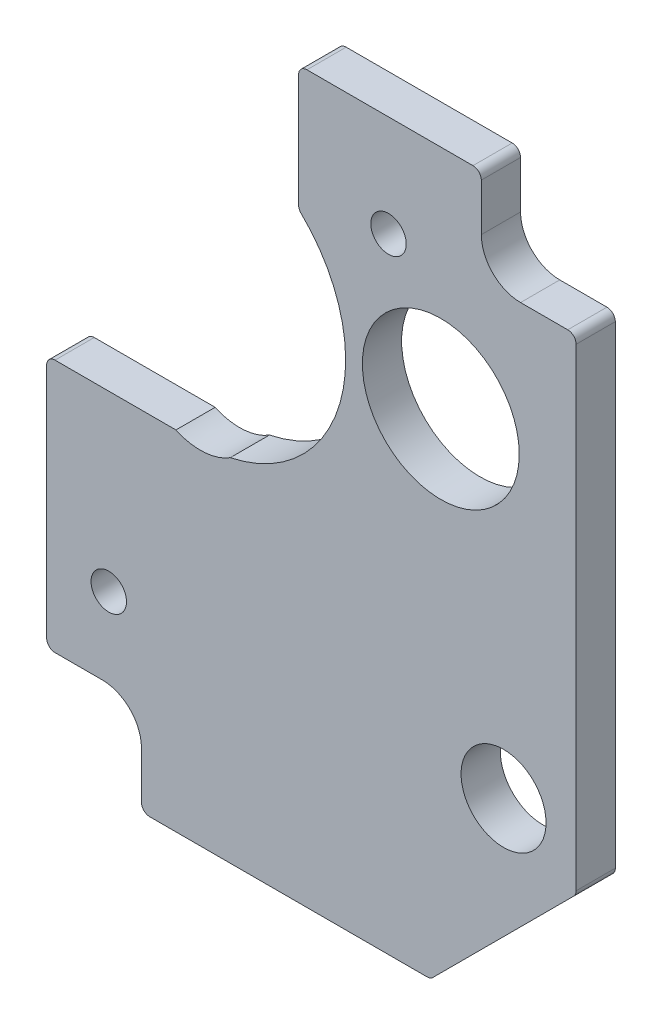
ISO-10303-21;
HEADER;
FILE_DESCRIPTION(('STEP AP214'),'2;1');
FILE_NAME('part.step','',(''),(''),'','','');
FILE_SCHEMA(('AUTOMOTIVE_DESIGN { 1 0 10303 214 1 1 1 1 }'));
ENDSEC;
DATA;
#1=APPLICATION_CONTEXT('core data for automotive mechanical design processes');
#2=APPLICATION_PROTOCOL_DEFINITION('international standard','automotive_design',2000,#1);
#3=PRODUCT_CONTEXT('',#1,'mechanical');
#4=PRODUCT('Part','Part','',(#3));
#5=PRODUCT_RELATED_PRODUCT_CATEGORY('part','',(#4));
#6=PRODUCT_DEFINITION_FORMATION('','',#4);
#7=PRODUCT_DEFINITION_CONTEXT('part definition',#1,'design');
#8=PRODUCT_DEFINITION('design','',#6,#7);
#9=PRODUCT_DEFINITION_SHAPE('','',#8);
#10=(LENGTH_UNIT() NAMED_UNIT(*) SI_UNIT(.MILLI.,.METRE.));
#11=(NAMED_UNIT(*) PLANE_ANGLE_UNIT() SI_UNIT($,.RADIAN.));
#12=(NAMED_UNIT(*) SI_UNIT($,.STERADIAN.) SOLID_ANGLE_UNIT());
#13=UNCERTAINTY_MEASURE_WITH_UNIT(LENGTH_MEASURE(1.E-05),#10,'distance_accuracy_value','');
#14=(GEOMETRIC_REPRESENTATION_CONTEXT(3) GLOBAL_UNCERTAINTY_ASSIGNED_CONTEXT((#13)) GLOBAL_UNIT_ASSIGNED_CONTEXT((#10,
#11,#12)) REPRESENTATION_CONTEXT('',''));
#15=CARTESIAN_POINT('',(0.,0.,0.));
#16=DIRECTION('',(0.,0.,1.));
#17=DIRECTION('',(1.,0.,0.));
#18=AXIS2_PLACEMENT_3D('',#15,#16,#17);
#19=CARTESIAN_POINT('',(-18.5024659793715,-87.4871250000004,4.7625));
#20=DIRECTION('',(0.,0.,-1.));
#21=DIRECTION('',(-1.,0.,0.));
#22=AXIS2_PLACEMENT_3D('',#19,#20,#21);
#23=CYLINDRICAL_SURFACE('',#22,1.016);
#24=CARTESIAN_POINT('',(-18.5024659793715,-87.4871250000004,0.));
#25=DIRECTION('',(0.,0.,1.));
#26=DIRECTION('',(1.,0.,0.));
#27=AXIS2_PLACEMENT_3D('',#24,#25,#26);
#28=CIRCLE('',#27,1.016);
#29=CARTESIAN_POINT('',(-18.5024659793715,-88.5031250000005,0.));
#30=VERTEX_POINT('',#29);
#31=CARTESIAN_POINT('',(-17.784045489686,-88.205545489686,0.));
#32=VERTEX_POINT('',#31);
#33=EDGE_CURVE('E236',#30,#32,#28,.T.);
#34=ORIENTED_EDGE('',*,*,#33,.T.);
#35=DIRECTION('',(0.,0.,-1.));
#36=VECTOR('',#35,1.);
#37=CARTESIAN_POINT('',(-17.784045489686,-88.205545489686,4.7625));
#38=LINE('',#37,#36);
#39=CARTESIAN_POINT('',(-17.784045489686,-88.205545489686,4.7625));
#40=VERTEX_POINT('',#39);
#41=EDGE_CURVE('E11',#40,#32,#38,.T.);
#42=ORIENTED_EDGE('',*,*,#41,.F.);
#43=CARTESIAN_POINT('',(-18.5024659793715,-87.4871250000004,4.7625));
#44=DIRECTION('',(0.,0.,1.));
#45=DIRECTION('',(1.,0.,0.));
#46=AXIS2_PLACEMENT_3D('',#43,#44,#45);
#47=CIRCLE('',#46,1.016);
#48=CARTESIAN_POINT('',(-18.5024659793715,-88.5031250000005,4.7625));
#49=VERTEX_POINT('',#48);
#50=EDGE_CURVE('E293',#49,#40,#47,.T.);
#51=ORIENTED_EDGE('',*,*,#50,.F.);
#52=DIRECTION('',(0.,0.,-1.));
#53=VECTOR('',#52,1.);
#54=CARTESIAN_POINT('',(-18.5024659793715,-88.5031250000005,4.7625));
#55=LINE('',#54,#53);
#56=EDGE_CURVE('E232',#49,#30,#55,.T.);
#57=ORIENTED_EDGE('',*,*,#56,.T.);
#58=EDGE_LOOP('',(#34,#42,#51,#57));
#59=FACE_BOUND('',#58,.T.);
#60=ADVANCED_FACE('F38',(#59),#23,.T.);
#61=CARTESIAN_POINT('',(-17.784045489686,-88.205545489686,4.7625));
#62=DIRECTION('',(-0.707106781186548,0.707106781186547,0.));
#63=DIRECTION('',(-0.707106781186547,-0.707106781186548,0.));
#64=AXIS2_PLACEMENT_3D('',#61,#62,#63);
#65=PLANE('',#64);
#66=DIRECTION('',(0.707106781186547,0.707106781186548,0.));
#67=VECTOR('',#66,1.);
#68=CARTESIAN_POINT('',(-17.784045489686,-88.205545489686,0.));
#69=LINE('',#68,#67);
#70=CARTESIAN_POINT('',(-0.694454510314901,-71.1159545103149,0.));
#71=VERTEX_POINT('',#70);
#72=EDGE_CURVE('E239',#32,#71,#69,.T.);
#73=ORIENTED_EDGE('',*,*,#72,.T.);
#74=DIRECTION('',(0.,0.,-1.));
#75=VECTOR('',#74,1.);
#76=CARTESIAN_POINT('',(-0.694454510314901,-71.1159545103149,4.7625));
#77=LINE('',#76,#75);
#78=CARTESIAN_POINT('',(-0.694454510314901,-71.1159545103149,4.7625));
#79=VERTEX_POINT('',#78);
#80=EDGE_CURVE('E46',#79,#71,#77,.T.);
#81=ORIENTED_EDGE('',*,*,#80,.F.);
#82=DIRECTION('',(0.707106781186547,0.707106781186548,0.));
#83=VECTOR('',#82,1.);
#84=CARTESIAN_POINT('',(-17.784045489686,-88.205545489686,4.7625));
#85=LINE('',#84,#83);
#86=EDGE_CURVE('E147',#40,#79,#85,.T.);
#87=ORIENTED_EDGE('',*,*,#86,.F.);
#88=ORIENTED_EDGE('',*,*,#41,.T.);
#89=EDGE_LOOP('',(#73,#81,#87,#88));
#90=FACE_BOUND('',#89,.T.);
#91=ADVANCED_FACE('F462',(#90),#65,.F.);
#92=CARTESIAN_POINT('',(-1.41287500000043,-70.3975340206292,4.7625));
#93=DIRECTION('',(0.,0.,-1.));
#94=DIRECTION('',(-1.,0.,0.));
#95=AXIS2_PLACEMENT_3D('',#92,#93,#94);
#96=CYLINDRICAL_SURFACE('',#95,1.01600000000007);
#97=CARTESIAN_POINT('',(-1.41287500000043,-70.3975340206292,0.));
#98=DIRECTION('',(0.,0.,1.));
#99=DIRECTION('',(1.,0.,0.));
#100=AXIS2_PLACEMENT_3D('',#97,#98,#99);
#101=CIRCLE('',#100,1.01600000000007);
#102=CARTESIAN_POINT('',(-0.396875000000381,-70.3975340206292,0.));
#103=VERTEX_POINT('',#102);
#104=EDGE_CURVE('E242',#71,#103,#101,.T.);
#105=ORIENTED_EDGE('',*,*,#104,.T.);
#106=DIRECTION('',(0.,0.,-1.));
#107=VECTOR('',#106,1.);
#108=CARTESIAN_POINT('',(-0.396875000000381,-70.3975340206292,4.7625));
#109=LINE('',#108,#107);
#110=CARTESIAN_POINT('',(-0.396875000000381,-70.3975340206292,4.7625));
#111=VERTEX_POINT('',#110);
#112=EDGE_CURVE('E352',#111,#103,#109,.T.);
#113=ORIENTED_EDGE('',*,*,#112,.F.);
#114=CARTESIAN_POINT('',(-1.41287500000043,-70.3975340206292,4.7625));
#115=DIRECTION('',(0.,0.,1.));
#116=DIRECTION('',(1.,0.,0.));
#117=AXIS2_PLACEMENT_3D('',#114,#115,#116);
#118=CIRCLE('',#117,1.01600000000007);
#119=EDGE_CURVE('E360',#79,#111,#118,.T.);
#120=ORIENTED_EDGE('',*,*,#119,.F.);
#121=ORIENTED_EDGE('',*,*,#80,.T.);
#122=EDGE_LOOP('',(#105,#113,#120,#121));
#123=FACE_BOUND('',#122,.T.);
#124=ADVANCED_FACE('F358',(#123),#96,.T.);
#125=CARTESIAN_POINT('',(-0.396875000000381,-70.3975340206292,4.7625));
#126=DIRECTION('',(-1.,0.,0.));
#127=DIRECTION('',(0.,-1.,0.));
#128=AXIS2_PLACEMENT_3D('',#125,#126,#127);
#129=PLANE('',#128);
#130=DIRECTION('',(0.,1.,0.));
#131=VECTOR('',#130,1.);
#132=CARTESIAN_POINT('',(-0.396875000000381,-70.3975340206292,0.));
#133=LINE('',#132,#131);
#134=CARTESIAN_POINT('',(-0.396875000000459,-12.9222500000004,0.));
#135=VERTEX_POINT('',#134);
#136=EDGE_CURVE('E244',#103,#135,#133,.T.);
#137=ORIENTED_EDGE('',*,*,#136,.T.);
#138=DIRECTION('',(0.,0.,-1.));
#139=VECTOR('',#138,1.);
#140=CARTESIAN_POINT('',(-0.396875000000459,-12.9222500000004,4.7625));
#141=LINE('',#140,#139);
#142=CARTESIAN_POINT('',(-0.396875000000459,-12.9222500000004,4.7625));
#143=VERTEX_POINT('',#142);
#144=EDGE_CURVE('E349',#143,#135,#141,.T.);
#145=ORIENTED_EDGE('',*,*,#144,.F.);
#146=DIRECTION('',(0.,1.,0.));
#147=VECTOR('',#146,1.);
#148=CARTESIAN_POINT('',(-0.396875000000381,-70.3975340206292,4.7625));
#149=LINE('',#148,#147);
#150=EDGE_CURVE('E378',#111,#143,#149,.T.);
#151=ORIENTED_EDGE('',*,*,#150,.F.);
#152=ORIENTED_EDGE('',*,*,#112,.T.);
#153=EDGE_LOOP('',(#137,#145,#151,#152));
#154=FACE_BOUND('',#153,.T.);
#155=ADVANCED_FACE('F369',(#154),#129,.F.);
#156=CARTESIAN_POINT('',(-1.41287500000046,-12.9222500000004,4.7625));
#157=DIRECTION('',(0.,0.,-1.));
#158=DIRECTION('',(-1.,0.,0.));
#159=AXIS2_PLACEMENT_3D('',#156,#157,#158);
#160=CYLINDRICAL_SURFACE('',#159,1.016);
#161=CARTESIAN_POINT('',(-1.41287500000046,-12.9222500000004,0.));
#162=DIRECTION('',(0.,0.,1.));
#163=DIRECTION('',(1.,0.,0.));
#164=AXIS2_PLACEMENT_3D('',#161,#162,#163);
#165=CIRCLE('',#164,1.016);
#166=CARTESIAN_POINT('',(-1.41287500000046,-11.9062500000004,0.));
#167=VERTEX_POINT('',#166);
#168=EDGE_CURVE('E247',#135,#167,#165,.T.);
#169=ORIENTED_EDGE('',*,*,#168,.T.);
#170=DIRECTION('',(0.,0.,-1.));
#171=VECTOR('',#170,1.);
#172=CARTESIAN_POINT('',(-1.41287500000046,-11.9062500000004,4.7625));
#173=LINE('',#172,#171);
#174=CARTESIAN_POINT('',(-1.41287500000046,-11.9062500000004,4.7625));
#175=VERTEX_POINT('',#174);
#176=EDGE_CURVE('E346',#175,#167,#173,.T.);
#177=ORIENTED_EDGE('',*,*,#176,.F.);
#178=CARTESIAN_POINT('',(-1.41287500000046,-12.9222500000004,4.7625));
#179=DIRECTION('',(0.,0.,1.));
#180=DIRECTION('',(1.,0.,0.));
#181=AXIS2_PLACEMENT_3D('',#178,#179,#180);
#182=CIRCLE('',#181,1.016);
#183=EDGE_CURVE('E375',#143,#175,#182,.T.);
#184=ORIENTED_EDGE('',*,*,#183,.F.);
#185=ORIENTED_EDGE('',*,*,#144,.T.);
#186=EDGE_LOOP('',(#169,#177,#184,#185));
#187=FACE_BOUND('',#186,.T.);
#188=ADVANCED_FACE('F373',(#187),#160,.T.);
#189=CARTESIAN_POINT('',(-1.41287500000046,-11.9062500000004,4.7625));
#190=DIRECTION('',(0.,-1.,0.));
#191=DIRECTION('',(1.,0.,0.));
#192=AXIS2_PLACEMENT_3D('',#189,#190,#191);
#193=PLANE('',#192);
#194=DIRECTION('',(-1.,0.,0.));
#195=VECTOR('',#194,1.);
#196=CARTESIAN_POINT('',(-1.41287500000046,-11.9062500000004,0.));
#197=LINE('',#196,#195);
#198=CARTESIAN_POINT('',(-7.14375000000044,-11.9062500000004,0.));
#199=VERTEX_POINT('',#198);
#200=EDGE_CURVE('E249',#167,#199,#197,.T.);
#201=ORIENTED_EDGE('',*,*,#200,.T.);
#202=DIRECTION('',(0.,0.,-1.));
#203=VECTOR('',#202,1.);
#204=CARTESIAN_POINT('',(-7.14375000000044,-11.9062500000004,4.7625));
#205=LINE('',#204,#203);
#206=CARTESIAN_POINT('',(-7.14375000000044,-11.9062500000004,4.7625));
#207=VERTEX_POINT('',#206);
#208=EDGE_CURVE('E343',#207,#199,#205,.T.);
#209=ORIENTED_EDGE('',*,*,#208,.F.);
#210=DIRECTION('',(-1.,0.,0.));
#211=VECTOR('',#210,1.);
#212=CARTESIAN_POINT('',(-1.41287500000046,-11.9062500000004,4.7625));
#213=LINE('',#212,#211);
#214=EDGE_CURVE('E377',#175,#207,#213,.T.);
#215=ORIENTED_EDGE('',*,*,#214,.F.);
#216=ORIENTED_EDGE('',*,*,#176,.T.);
#217=EDGE_LOOP('',(#201,#209,#215,#216));
#218=FACE_BOUND('',#217,.T.);
#219=ADVANCED_FACE('F452',(#218),#193,.F.);
#220=CARTESIAN_POINT('',(-7.14375000000044,-7.14375000000045,4.7625));
#221=DIRECTION('',(0.,0.,-1.));
#222=DIRECTION('',(-1.,0.,0.));
#223=AXIS2_PLACEMENT_3D('',#220,#221,#222);
#224=CYLINDRICAL_SURFACE('',#223,4.7625);
#225=CARTESIAN_POINT('',(-7.14375000000044,-7.14375000000045,0.));
#226=DIRECTION('',(0.,0.,-1.));
#227=DIRECTION('',(1.,0.,0.));
#228=AXIS2_PLACEMENT_3D('',#225,#226,#227);
#229=CIRCLE('',#228,4.7625);
#230=CARTESIAN_POINT('',(-11.9062500000004,-7.14375000000045,0.));
#231=VERTEX_POINT('',#230);
#232=EDGE_CURVE('E251',#199,#231,#229,.T.);
#233=ORIENTED_EDGE('',*,*,#232,.T.);
#234=DIRECTION('',(0.,0.,-1.));
#235=VECTOR('',#234,1.);
#236=CARTESIAN_POINT('',(-11.9062500000004,-7.14375000000045,4.7625));
#237=LINE('',#236,#235);
#238=CARTESIAN_POINT('',(-11.9062500000004,-7.14375000000045,4.7625));
#239=VERTEX_POINT('',#238);
#240=EDGE_CURVE('E340',#239,#231,#237,.T.);
#241=ORIENTED_EDGE('',*,*,#240,.F.);
#242=CARTESIAN_POINT('',(-7.14375000000044,-7.14375000000045,4.7625));
#243=DIRECTION('',(0.,0.,-1.));
#244=DIRECTION('',(1.,0.,0.));
#245=AXIS2_PLACEMENT_3D('',#242,#243,#244);
#246=CIRCLE('',#245,4.7625);
#247=EDGE_CURVE('E380',#207,#239,#246,.T.);
#248=ORIENTED_EDGE('',*,*,#247,.F.);
#249=ORIENTED_EDGE('',*,*,#208,.T.);
#250=EDGE_LOOP('',(#233,#241,#248,#249));
#251=FACE_BOUND('',#250,.T.);
#252=ADVANCED_FACE('F448',(#251),#224,.F.);
#253=CARTESIAN_POINT('',(-11.9062500000004,-7.14375000000045,4.7625));
#254=DIRECTION('',(-1.,0.,0.));
#255=DIRECTION('',(0.,0.,1.));
#256=AXIS2_PLACEMENT_3D('',#253,#254,#255);
#257=PLANE('',#256);
#258=DIRECTION('',(0.,1.,0.));
#259=VECTOR('',#258,1.);
#260=CARTESIAN_POINT('',(-11.9062500000004,-7.14375000000045,0.));
#261=LINE('',#260,#259);
#262=CARTESIAN_POINT('',(-11.9062500000004,-1.41287500000045,0.));
#263=VERTEX_POINT('',#262);
#264=EDGE_CURVE('E253',#231,#263,#261,.T.);
#265=ORIENTED_EDGE('',*,*,#264,.T.);
#266=DIRECTION('',(0.,0.,-1.));
#267=VECTOR('',#266,1.);
#268=CARTESIAN_POINT('',(-11.9062500000004,-1.41287500000045,4.7625));
#269=LINE('',#268,#267);
#270=CARTESIAN_POINT('',(-11.9062500000004,-1.41287500000045,4.7625));
#271=VERTEX_POINT('',#270);
#272=EDGE_CURVE('E337',#271,#263,#269,.T.);
#273=ORIENTED_EDGE('',*,*,#272,.F.);
#274=DIRECTION('',(0.,1.,0.));
#275=VECTOR('',#274,1.);
#276=CARTESIAN_POINT('',(-11.9062500000004,-7.14375000000045,4.7625));
#277=LINE('',#276,#275);
#278=EDGE_CURVE('E387',#239,#271,#277,.T.);
#279=ORIENTED_EDGE('',*,*,#278,.F.);
#280=ORIENTED_EDGE('',*,*,#240,.T.);
#281=EDGE_LOOP('',(#265,#273,#279,#280));
#282=FACE_BOUND('',#281,.T.);
#283=ADVANCED_FACE('F444',(#282),#257,.F.);
#284=CARTESIAN_POINT('',(-12.9222500000004,-1.41287500000045,4.7625));
#285=DIRECTION('',(0.,0.,-1.));
#286=DIRECTION('',(-1.,0.,0.));
#287=AXIS2_PLACEMENT_3D('',#284,#285,#286);
#288=CYLINDRICAL_SURFACE('',#287,1.016);
#289=CARTESIAN_POINT('',(-12.9222500000004,-1.41287500000045,0.));
#290=DIRECTION('',(0.,0.,1.));
#291=DIRECTION('',(1.,0.,0.));
#292=AXIS2_PLACEMENT_3D('',#289,#290,#291);
#293=CIRCLE('',#292,1.016);
#294=CARTESIAN_POINT('',(-12.9222500000004,-0.396875000000448,0.));
#295=VERTEX_POINT('',#294);
#296=EDGE_CURVE('E255',#263,#295,#293,.T.);
#297=ORIENTED_EDGE('',*,*,#296,.T.);
#298=DIRECTION('',(0.,0.,-1.));
#299=VECTOR('',#298,1.);
#300=CARTESIAN_POINT('',(-12.9222500000004,-0.396875000000448,4.7625));
#301=LINE('',#300,#299);
#302=CARTESIAN_POINT('',(-12.9222500000004,-0.396875000000448,4.7625));
#303=VERTEX_POINT('',#302);
#304=EDGE_CURVE('E334',#303,#295,#301,.T.);
#305=ORIENTED_EDGE('',*,*,#304,.F.);
#306=CARTESIAN_POINT('',(-12.9222500000004,-1.41287500000045,4.7625));
#307=DIRECTION('',(0.,0.,1.));
#308=DIRECTION('',(1.,0.,0.));
#309=AXIS2_PLACEMENT_3D('',#306,#307,#308);
#310=CIRCLE('',#309,1.016);
#311=EDGE_CURVE('E389',#271,#303,#310,.T.);
#312=ORIENTED_EDGE('',*,*,#311,.F.);
#313=ORIENTED_EDGE('',*,*,#272,.T.);
#314=EDGE_LOOP('',(#297,#305,#312,#313));
#315=FACE_BOUND('',#314,.T.);
#316=ADVANCED_FACE('F440',(#315),#288,.T.);
#317=CARTESIAN_POINT('',(-12.9222500000004,-0.396875000000448,4.7625));
#318=DIRECTION('',(0.,-1.,0.));
#319=DIRECTION('',(1.,0.,0.));
#320=AXIS2_PLACEMENT_3D('',#317,#318,#319);
#321=PLANE('',#320);
#322=DIRECTION('',(-1.,0.,0.));
#323=VECTOR('',#322,1.);
#324=CARTESIAN_POINT('',(-12.9222500000004,-0.396875000000448,0.));
#325=LINE('',#324,#323);
#326=CARTESIAN_POINT('',(-33.0835000000004,-0.396875000000452,0.));
#327=VERTEX_POINT('',#326);
#328=EDGE_CURVE('E257',#295,#327,#325,.T.);
#329=ORIENTED_EDGE('',*,*,#328,.T.);
#330=DIRECTION('',(0.,0.,-1.));
#331=VECTOR('',#330,1.);
#332=CARTESIAN_POINT('',(-33.0835000000004,-0.396875000000452,4.7625));
#333=LINE('',#332,#331);
#334=CARTESIAN_POINT('',(-33.0835000000004,-0.396875000000452,4.7625));
#335=VERTEX_POINT('',#334);
#336=EDGE_CURVE('E331',#335,#327,#333,.T.);
#337=ORIENTED_EDGE('',*,*,#336,.F.);
#338=DIRECTION('',(-1.,0.,0.));
#339=VECTOR('',#338,1.);
#340=CARTESIAN_POINT('',(-12.9222500000004,-0.396875000000448,4.7625));
#341=LINE('',#340,#339);
#342=EDGE_CURVE('E391',#303,#335,#341,.T.);
#343=ORIENTED_EDGE('',*,*,#342,.F.);
#344=ORIENTED_EDGE('',*,*,#304,.T.);
#345=EDGE_LOOP('',(#329,#337,#343,#344));
#346=FACE_BOUND('',#345,.T.);
#347=ADVANCED_FACE('F436',(#346),#321,.F.);
#348=CARTESIAN_POINT('',(-33.0835000000004,-1.41287500000045,4.7625));
#349=DIRECTION('',(0.,0.,-1.));
#350=DIRECTION('',(-1.,0.,0.));
#351=AXIS2_PLACEMENT_3D('',#348,#349,#350);
#352=CYLINDRICAL_SURFACE('',#351,1.016);
#353=CARTESIAN_POINT('',(-33.0835000000004,-1.41287500000045,0.));
#354=DIRECTION('',(0.,0.,1.));
#355=DIRECTION('',(1.,0.,0.));
#356=AXIS2_PLACEMENT_3D('',#353,#354,#355);
#357=CIRCLE('',#356,1.016);
#358=CARTESIAN_POINT('',(-34.0995000000004,-1.41287500000045,0.));
#359=VERTEX_POINT('',#358);
#360=EDGE_CURVE('E259',#327,#359,#357,.T.);
#361=ORIENTED_EDGE('',*,*,#360,.T.);
#362=DIRECTION('',(0.,0.,-1.));
#363=VECTOR('',#362,1.);
#364=CARTESIAN_POINT('',(-34.0995000000004,-1.41287500000045,4.7625));
#365=LINE('',#364,#363);
#366=CARTESIAN_POINT('',(-34.0995000000004,-1.41287500000045,4.7625));
#367=VERTEX_POINT('',#366);
#368=EDGE_CURVE('E328',#367,#359,#365,.T.);
#369=ORIENTED_EDGE('',*,*,#368,.F.);
#370=CARTESIAN_POINT('',(-33.0835000000004,-1.41287500000045,4.7625));
#371=DIRECTION('',(0.,0.,1.));
#372=DIRECTION('',(1.,0.,0.));
#373=AXIS2_PLACEMENT_3D('',#370,#371,#372);
#374=CIRCLE('',#373,1.016);
#375=EDGE_CURVE('E393',#335,#367,#374,.T.);
#376=ORIENTED_EDGE('',*,*,#375,.F.);
#377=ORIENTED_EDGE('',*,*,#336,.T.);
#378=EDGE_LOOP('',(#361,#369,#376,#377));
#379=FACE_BOUND('',#378,.T.);
#380=ADVANCED_FACE('F432',(#379),#352,.T.);
#381=CARTESIAN_POINT('',(-34.0995000000004,-1.41287500000045,4.7625));
#382=DIRECTION('',(1.,0.,0.));
#383=DIRECTION('',(0.,1.,0.));
#384=AXIS2_PLACEMENT_3D('',#381,#382,#383);
#385=PLANE('',#384);
#386=DIRECTION('',(0.,-1.,0.));
#387=VECTOR('',#386,1.);
#388=CARTESIAN_POINT('',(-34.0995000000004,-1.41287500000045,0.));
#389=LINE('',#388,#387);
#390=CARTESIAN_POINT('',(-34.0995000000004,-15.1315835815449,0.));
#391=VERTEX_POINT('',#390);
#392=EDGE_CURVE('E261',#359,#391,#389,.T.);
#393=ORIENTED_EDGE('',*,*,#392,.T.);
#394=DIRECTION('',(0.,0.,-1.));
#395=VECTOR('',#394,1.);
#396=CARTESIAN_POINT('',(-34.0995000000004,-15.1315835815449,4.7625));
#397=LINE('',#396,#395);
#398=CARTESIAN_POINT('',(-34.0995000000004,-15.1315835815449,4.7625));
#399=VERTEX_POINT('',#398);
#400=EDGE_CURVE('E325',#399,#391,#397,.T.);
#401=ORIENTED_EDGE('',*,*,#400,.F.);
#402=DIRECTION('',(0.,-1.,0.));
#403=VECTOR('',#402,1.);
#404=CARTESIAN_POINT('',(-34.0995000000004,-1.41287500000045,4.7625));
#405=LINE('',#404,#403);
#406=EDGE_CURVE('E395',#367,#399,#405,.T.);
#407=ORIENTED_EDGE('',*,*,#406,.F.);
#408=ORIENTED_EDGE('',*,*,#368,.T.);
#409=EDGE_LOOP('',(#393,#401,#407,#408));
#410=FACE_BOUND('',#409,.T.);
#411=ADVANCED_FACE('F428',(#410),#385,.F.);
#412=CARTESIAN_POINT('',(-33.0835000000004,-15.1315835815449,4.7625));
#413=DIRECTION('',(0.,0.,-1.));
#414=DIRECTION('',(-1.,0.,0.));
#415=AXIS2_PLACEMENT_3D('',#412,#413,#414);
#416=CYLINDRICAL_SURFACE('',#415,1.01599999999999);
#417=CARTESIAN_POINT('',(-33.0835000000004,-15.1315835815449,0.));
#418=DIRECTION('',(0.,0.,1.));
#419=DIRECTION('',(1.,0.,0.));
#420=AXIS2_PLACEMENT_3D('',#417,#418,#419);
#421=CIRCLE('',#420,1.01599999999999);
#422=CARTESIAN_POINT('',(-33.7884795918372,-15.8631980805084,0.));
#423=VERTEX_POINT('',#422);
#424=EDGE_CURVE('E263',#391,#423,#421,.T.);
#425=ORIENTED_EDGE('',*,*,#424,.T.);
#426=DIRECTION('',(0.,0.,-1.));
#427=VECTOR('',#426,1.);
#428=CARTESIAN_POINT('',(-33.7884795918372,-15.8631980805084,4.7625));
#429=LINE('',#428,#427);
#430=CARTESIAN_POINT('',(-33.7884795918372,-15.8631980805084,4.7625));
#431=VERTEX_POINT('',#430);
#432=EDGE_CURVE('E322',#431,#423,#429,.T.);
#433=ORIENTED_EDGE('',*,*,#432,.F.);
#434=CARTESIAN_POINT('',(-33.0835000000004,-15.1315835815449,4.7625));
#435=DIRECTION('',(0.,0.,1.));
#436=DIRECTION('',(1.,0.,0.));
#437=AXIS2_PLACEMENT_3D('',#434,#435,#436);
#438=CIRCLE('',#437,1.01599999999999);
#439=EDGE_CURVE('E397',#399,#431,#438,.T.);
#440=ORIENTED_EDGE('',*,*,#439,.F.);
#441=ORIENTED_EDGE('',*,*,#400,.T.);
#442=EDGE_LOOP('',(#425,#433,#440,#441));
#443=FACE_BOUND('',#442,.T.);
#444=ADVANCED_FACE('F424',(#443),#416,.T.);
#445=CARTESIAN_POINT('',(-46.0375000000004,-28.5750000000005,4.7625));
#446=DIRECTION('',(0.,0.,-1.));
#447=DIRECTION('',(-1.,0.,0.));
#448=AXIS2_PLACEMENT_3D('',#445,#446,#447);
#449=CYLINDRICAL_SURFACE('',#448,17.653);
#450=CARTESIAN_POINT('',(-46.0375000000004,-28.5750000000005,0.));
#451=DIRECTION('',(0.,0.,-1.));
#452=DIRECTION('',(1.,0.,0.));
#453=AXIS2_PLACEMENT_3D('',#450,#451,#452);
#454=CIRCLE('',#453,17.653);
#455=CARTESIAN_POINT('',(-42.3979028671247,-45.8487298146747,0.));
#456=VERTEX_POINT('',#455);
#457=EDGE_CURVE('E265',#423,#456,#454,.T.);
#458=ORIENTED_EDGE('',*,*,#457,.T.);
#459=DIRECTION('',(0.,0.,-1.));
#460=VECTOR('',#459,1.);
#461=CARTESIAN_POINT('',(-42.3979028671247,-45.8487298146747,4.7625));
#462=LINE('',#461,#460);
#463=CARTESIAN_POINT('',(-42.3979028671247,-45.8487298146747,4.7625));
#464=VERTEX_POINT('',#463);
#465=EDGE_CURVE('E318',#464,#456,#462,.T.);
#466=ORIENTED_EDGE('',*,*,#465,.F.);
#467=CARTESIAN_POINT('',(-46.0375000000004,-28.5750000000005,4.7625));
#468=DIRECTION('',(0.,0.,-1.));
#469=DIRECTION('',(1.,0.,0.));
#470=AXIS2_PLACEMENT_3D('',#467,#468,#469);
#471=CIRCLE('',#470,17.653);
#472=EDGE_CURVE('E399',#431,#464,#471,.T.);
#473=ORIENTED_EDGE('',*,*,#472,.F.);
#474=ORIENTED_EDGE('',*,*,#432,.T.);
#475=EDGE_LOOP('',(#458,#466,#473,#474));
#476=FACE_BOUND('',#475,.T.);
#477=ADVANCED_FACE('F419',(#476),#449,.F.);
#478=CARTESIAN_POINT('',(-42.3979028671247,-45.8487298146747,4.7625));
#479=CARTESIAN_POINT('',(-45.5517831985528,-47.8607532054006,4.7625));
#480=CARTESIAN_POINT('',(-48.9910262425178,-46.2280000000004,4.7625));
#481=(BOUNDED_CURVE() B_SPLINE_CURVE(2,(#478,#479,#480),.UNSPECIFIED.,.F.,
.F.) B_SPLINE_CURVE_WITH_KNOTS((3,3),(-2.21061099064347,-1.06500214378853),
.UNSPECIFIED.) CURVE() GEOMETRIC_REPRESENTATION_ITEM() RATIONAL_B_SPLINE_CURVE((1.,
0.840384309700957,1.)) REPRESENTATION_ITEM(''));
#482=DIRECTION('',(0.,0.,-1.));
#483=VECTOR('',#482,1.);
#484=SURFACE_OF_LINEAR_EXTRUSION('',#481,#483);
#485=CARTESIAN_POINT('',(-42.3979028671247,-45.8487298146747,0.));
#486=CARTESIAN_POINT('',(-45.5517831985528,-47.8607532054006,0.));
#487=CARTESIAN_POINT('',(-48.9910262425178,-46.2280000000004,0.));
#488=(BOUNDED_CURVE() B_SPLINE_CURVE(2,(#485,#486,#487),.UNSPECIFIED.,.F.,
.F.) B_SPLINE_CURVE_WITH_KNOTS((3,3),(-2.21061099064347,-1.06500214378853),
.UNSPECIFIED.) CURVE() GEOMETRIC_REPRESENTATION_ITEM() RATIONAL_B_SPLINE_CURVE((1.,
0.840384309700957,1.)) REPRESENTATION_ITEM(''));
#489=CARTESIAN_POINT('',(-48.9910262425178,-46.2280000000004,0.));
#490=VERTEX_POINT('',#489);
#491=EDGE_CURVE('E268',#456,#490,#488,.T.);
#492=ORIENTED_EDGE('',*,*,#491,.T.);
#493=DIRECTION('',(0.,0.,-1.));
#494=VECTOR('',#493,1.);
#495=CARTESIAN_POINT('',(-48.9910262425178,-46.2280000000004,4.7625));
#496=LINE('',#495,#494);
#497=CARTESIAN_POINT('',(-48.9910262425178,-46.2280000000004,4.7625));
#498=VERTEX_POINT('',#497);
#499=EDGE_CURVE('E314',#498,#490,#496,.T.);
#500=ORIENTED_EDGE('',*,*,#499,.F.);
#501=EDGE_CURVE('E402',#464,#498,#481,.T.);
#502=ORIENTED_EDGE('',*,*,#501,.F.);
#503=ORIENTED_EDGE('',*,*,#465,.T.);
#504=EDGE_LOOP('',(#492,#500,#502,#503));
#505=FACE_BOUND('',#504,.T.);
#506=ADVANCED_FACE('F414',(#505),#484,.F.);
#507=CARTESIAN_POINT('',(-48.9910262425178,-46.2280000000004,4.7625));
#508=DIRECTION('',(0.,-1.,0.));
#509=DIRECTION('',(1.,0.,0.));
#510=AXIS2_PLACEMENT_3D('',#507,#508,#509);
#511=PLANE('',#510);
#512=DIRECTION('',(-1.,0.,0.));
#513=VECTOR('',#512,1.);
#514=CARTESIAN_POINT('',(-48.9910262425178,-46.2280000000004,0.));
#515=LINE('',#514,#513);
#516=CARTESIAN_POINT('',(-63.6746250000004,-46.2280000000005,0.));
#517=VERTEX_POINT('',#516);
#518=EDGE_CURVE('E273',#490,#517,#515,.T.);
#519=ORIENTED_EDGE('',*,*,#518,.T.);
#520=DIRECTION('',(0.,0.,-1.));
#521=VECTOR('',#520,1.);
#522=CARTESIAN_POINT('',(-63.6746250000004,-46.2280000000005,4.7625));
#523=LINE('',#522,#521);
#524=CARTESIAN_POINT('',(-63.6746250000004,-46.2280000000005,4.7625));
#525=VERTEX_POINT('',#524);
#526=EDGE_CURVE('E310',#525,#517,#523,.T.);
#527=ORIENTED_EDGE('',*,*,#526,.F.);
#528=DIRECTION('',(-1.,0.,0.));
#529=VECTOR('',#528,1.);
#530=CARTESIAN_POINT('',(-48.9910262425178,-46.2280000000004,4.7625));
#531=LINE('',#530,#529);
#532=EDGE_CURVE('E408',#498,#525,#531,.T.);
#533=ORIENTED_EDGE('',*,*,#532,.F.);
#534=ORIENTED_EDGE('',*,*,#499,.T.);
#535=EDGE_LOOP('',(#519,#527,#533,#534));
#536=FACE_BOUND('',#535,.T.);
#537=ADVANCED_FACE('F418',(#536),#511,.F.);
#538=CARTESIAN_POINT('',(-63.6746250000004,-47.2440000000005,4.7625));
#539=DIRECTION('',(0.,0.,-1.));
#540=DIRECTION('',(-1.,0.,0.));
#541=AXIS2_PLACEMENT_3D('',#538,#539,#540);
#542=CYLINDRICAL_SURFACE('',#541,1.016);
#543=CARTESIAN_POINT('',(-63.6746250000004,-47.2440000000005,0.));
#544=DIRECTION('',(0.,0.,1.));
#545=DIRECTION('',(1.,0.,0.));
#546=AXIS2_PLACEMENT_3D('',#543,#544,#545);
#547=CIRCLE('',#546,1.016);
#548=CARTESIAN_POINT('',(-64.6906250000005,-47.2440000000005,0.));
#549=VERTEX_POINT('',#548);
#550=EDGE_CURVE('E279',#517,#549,#547,.T.);
#551=ORIENTED_EDGE('',*,*,#550,.T.);
#552=DIRECTION('',(0.,0.,-1.));
#553=VECTOR('',#552,1.);
#554=CARTESIAN_POINT('',(-64.6906250000005,-47.2440000000005,4.7625));
#555=LINE('',#554,#553);
#556=CARTESIAN_POINT('',(-64.6906250000005,-47.2440000000005,4.7625));
#557=VERTEX_POINT('',#556);
#558=EDGE_CURVE('E306',#557,#549,#555,.T.);
#559=ORIENTED_EDGE('',*,*,#558,.F.);
#560=CARTESIAN_POINT('',(-63.6746250000004,-47.2440000000005,4.7625));
#561=DIRECTION('',(0.,0.,1.));
#562=DIRECTION('',(1.,0.,0.));
#563=AXIS2_PLACEMENT_3D('',#560,#561,#562);
#564=CIRCLE('',#563,1.016);
#565=EDGE_CURVE('E497',#525,#557,#564,.T.);
#566=ORIENTED_EDGE('',*,*,#565,.F.);
#567=ORIENTED_EDGE('',*,*,#526,.T.);
#568=EDGE_LOOP('',(#551,#559,#566,#567));
#569=FACE_BOUND('',#568,.T.);
#570=ADVANCED_FACE('F496',(#569),#542,.T.);
#571=CARTESIAN_POINT('',(-64.6906250000005,-47.2440000000005,4.7625));
#572=DIRECTION('',(1.,0.,0.));
#573=DIRECTION('',(0.,0.,-1.));
#574=AXIS2_PLACEMENT_3D('',#571,#572,#573);
#575=PLANE('',#574);
#576=DIRECTION('',(0.,-1.,0.));
#577=VECTOR('',#576,1.);
#578=CARTESIAN_POINT('',(-64.6906250000005,-47.2440000000005,0.));
#579=LINE('',#578,#577);
#580=CARTESIAN_POINT('',(-64.6906250000005,-75.9777500000005,0.));
#581=VERTEX_POINT('',#580);
#582=EDGE_CURVE('E282',#549,#581,#579,.T.);
#583=ORIENTED_EDGE('',*,*,#582,.T.);
#584=DIRECTION('',(0.,0.,-1.));
#585=VECTOR('',#584,1.);
#586=CARTESIAN_POINT('',(-64.6906250000005,-75.9777500000005,4.7625));
#587=LINE('',#586,#585);
#588=CARTESIAN_POINT('',(-64.6906250000005,-75.9777500000005,4.7625));
#589=VERTEX_POINT('',#588);
#590=EDGE_CURVE('E303',#589,#581,#587,.T.);
#591=ORIENTED_EDGE('',*,*,#590,.F.);
#592=DIRECTION('',(0.,-1.,0.));
#593=VECTOR('',#592,1.);
#594=CARTESIAN_POINT('',(-64.6906250000005,-47.2440000000005,4.7625));
#595=LINE('',#594,#593);
#596=EDGE_CURVE('E493',#557,#589,#595,.T.);
#597=ORIENTED_EDGE('',*,*,#596,.F.);
#598=ORIENTED_EDGE('',*,*,#558,.T.);
#599=EDGE_LOOP('',(#583,#591,#597,#598));
#600=FACE_BOUND('',#599,.T.);
#601=ADVANCED_FACE('F490',(#600),#575,.F.);
#602=CARTESIAN_POINT('',(-63.6746250000004,-75.9777500000005,4.7625));
#603=DIRECTION('',(0.,0.,-1.));
#604=DIRECTION('',(-1.,0.,0.));
#605=AXIS2_PLACEMENT_3D('',#602,#603,#604);
#606=CYLINDRICAL_SURFACE('',#605,1.01600000000002);
#607=CARTESIAN_POINT('',(-63.6746250000004,-75.9777500000005,0.));
#608=DIRECTION('',(0.,0.,1.));
#609=DIRECTION('',(1.,0.,0.));
#610=AXIS2_PLACEMENT_3D('',#607,#608,#609);
#611=CIRCLE('',#610,1.01600000000002);
#612=CARTESIAN_POINT('',(-63.6746250000004,-76.9937500000005,0.));
#613=VERTEX_POINT('',#612);
#614=EDGE_CURVE('E284',#581,#613,#611,.T.);
#615=ORIENTED_EDGE('',*,*,#614,.T.);
#616=DIRECTION('',(0.,0.,-1.));
#617=VECTOR('',#616,1.);
#618=CARTESIAN_POINT('',(-63.6746250000004,-76.9937500000005,4.7625));
#619=LINE('',#618,#617);
#620=CARTESIAN_POINT('',(-63.6746250000004,-76.9937500000005,4.7625));
#621=VERTEX_POINT('',#620);
#622=EDGE_CURVE('E300',#621,#613,#619,.T.);
#623=ORIENTED_EDGE('',*,*,#622,.F.);
#624=CARTESIAN_POINT('',(-63.6746250000004,-75.9777500000005,4.7625));
#625=DIRECTION('',(0.,0.,1.));
#626=DIRECTION('',(1.,0.,0.));
#627=AXIS2_PLACEMENT_3D('',#624,#625,#626);
#628=CIRCLE('',#627,1.01600000000002);
#629=EDGE_CURVE('E484',#589,#621,#628,.T.);
#630=ORIENTED_EDGE('',*,*,#629,.F.);
#631=ORIENTED_EDGE('',*,*,#590,.T.);
#632=EDGE_LOOP('',(#615,#623,#630,#631));
#633=FACE_BOUND('',#632,.T.);
#634=ADVANCED_FACE('F483',(#633),#606,.T.);
#635=CARTESIAN_POINT('',(-63.6746250000004,-76.9937500000005,4.7625));
#636=DIRECTION('',(0.,1.,0.));
#637=DIRECTION('',(-1.,0.,0.));
#638=AXIS2_PLACEMENT_3D('',#635,#636,#637);
#639=PLANE('',#638);
#640=DIRECTION('',(1.,0.,0.));
#641=VECTOR('',#640,1.);
#642=CARTESIAN_POINT('',(-63.6746250000004,-76.9937500000005,0.));
#643=LINE('',#642,#641);
#644=CARTESIAN_POINT('',(-57.9437500000004,-76.9937500000005,0.));
#645=VERTEX_POINT('',#644);
#646=EDGE_CURVE('E286',#613,#645,#643,.T.);
#647=ORIENTED_EDGE('',*,*,#646,.T.);
#648=DIRECTION('',(0.,0.,-1.));
#649=VECTOR('',#648,1.);
#650=CARTESIAN_POINT('',(-57.9437500000004,-76.9937500000005,4.7625));
#651=LINE('',#650,#649);
#652=CARTESIAN_POINT('',(-57.9437500000004,-76.9937500000005,4.7625));
#653=VERTEX_POINT('',#652);
#654=EDGE_CURVE('E297',#653,#645,#651,.T.);
#655=ORIENTED_EDGE('',*,*,#654,.F.);
#656=DIRECTION('',(1.,0.,0.));
#657=VECTOR('',#656,1.);
#658=CARTESIAN_POINT('',(-63.6746250000004,-76.9937500000005,4.7625));
#659=LINE('',#658,#657);
#660=EDGE_CURVE('E479',#621,#653,#659,.T.);
#661=ORIENTED_EDGE('',*,*,#660,.F.);
#662=ORIENTED_EDGE('',*,*,#622,.T.);
#663=EDGE_LOOP('',(#647,#655,#661,#662));
#664=FACE_BOUND('',#663,.T.);
#665=ADVANCED_FACE('F478',(#664),#639,.F.);
#666=CARTESIAN_POINT('',(-57.9437500000004,-81.7562500000005,4.7625));
#667=DIRECTION('',(0.,0.,-1.));
#668=DIRECTION('',(-1.,0.,0.));
#669=AXIS2_PLACEMENT_3D('',#666,#667,#668);
#670=CYLINDRICAL_SURFACE('',#669,4.7625);
#671=CARTESIAN_POINT('',(-57.9437500000004,-81.7562500000005,0.));
#672=DIRECTION('',(0.,0.,-1.));
#673=DIRECTION('',(1.,0.,0.));
#674=AXIS2_PLACEMENT_3D('',#671,#672,#673);
#675=CIRCLE('',#674,4.7625);
#676=CARTESIAN_POINT('',(-53.1812500000004,-81.7562500000005,0.));
#677=VERTEX_POINT('',#676);
#678=EDGE_CURVE('E288',#645,#677,#675,.T.);
#679=ORIENTED_EDGE('',*,*,#678,.T.);
#680=DIRECTION('',(0.,0.,-1.));
#681=VECTOR('',#680,1.);
#682=CARTESIAN_POINT('',(-53.1812500000004,-81.7562500000005,4.7625));
#683=LINE('',#682,#681);
#684=CARTESIAN_POINT('',(-53.1812500000004,-81.7562500000005,4.7625));
#685=VERTEX_POINT('',#684);
#686=EDGE_CURVE('E227',#685,#677,#683,.T.);
#687=ORIENTED_EDGE('',*,*,#686,.F.);
#688=CARTESIAN_POINT('',(-57.9437500000004,-81.7562500000005,4.7625));
#689=DIRECTION('',(0.,0.,-1.));
#690=DIRECTION('',(1.,0.,0.));
#691=AXIS2_PLACEMENT_3D('',#688,#689,#690);
#692=CIRCLE('',#691,4.7625);
#693=EDGE_CURVE('E218',#653,#685,#692,.T.);
#694=ORIENTED_EDGE('',*,*,#693,.F.);
#695=ORIENTED_EDGE('',*,*,#654,.T.);
#696=EDGE_LOOP('',(#679,#687,#694,#695));
#697=FACE_BOUND('',#696,.T.);
#698=ADVANCED_FACE('F474',(#697),#670,.F.);
#699=CARTESIAN_POINT('',(-53.1812500000004,-81.7562500000005,4.7625));
#700=DIRECTION('',(1.,0.,0.));
#701=DIRECTION('',(0.,1.,0.));
#702=AXIS2_PLACEMENT_3D('',#699,#700,#701);
#703=PLANE('',#702);
#704=DIRECTION('',(0.,-1.,0.));
#705=VECTOR('',#704,1.);
#706=CARTESIAN_POINT('',(-53.1812500000004,-81.7562500000005,0.));
#707=LINE('',#706,#705);
#708=CARTESIAN_POINT('',(-53.1812500000004,-87.4871250000005,0.));
#709=VERTEX_POINT('',#708);
#710=EDGE_CURVE('E226',#677,#709,#707,.T.);
#711=ORIENTED_EDGE('',*,*,#710,.T.);
#712=DIRECTION('',(0.,0.,-1.));
#713=VECTOR('',#712,1.);
#714=CARTESIAN_POINT('',(-53.1812500000004,-87.4871250000005,4.7625));
#715=LINE('',#714,#713);
#716=CARTESIAN_POINT('',(-53.1812500000004,-87.4871250000005,4.7625));
#717=VERTEX_POINT('',#716);
#718=EDGE_CURVE('E223',#717,#709,#715,.T.);
#719=ORIENTED_EDGE('',*,*,#718,.F.);
#720=DIRECTION('',(0.,-1.,0.));
#721=VECTOR('',#720,1.);
#722=CARTESIAN_POINT('',(-53.1812500000004,-81.7562500000005,4.7625));
#723=LINE('',#722,#721);
#724=EDGE_CURVE('E212',#685,#717,#723,.T.);
#725=ORIENTED_EDGE('',*,*,#724,.F.);
#726=ORIENTED_EDGE('',*,*,#686,.T.);
#727=EDGE_LOOP('',(#711,#719,#725,#726));
#728=FACE_BOUND('',#727,.T.);
#729=ADVANCED_FACE('F224',(#728),#703,.F.);
#730=CARTESIAN_POINT('',(-52.1652500000004,-87.4871250000005,4.7625));
#731=DIRECTION('',(0.,0.,-1.));
#732=DIRECTION('',(-1.,0.,0.));
#733=AXIS2_PLACEMENT_3D('',#730,#731,#732);
#734=CYLINDRICAL_SURFACE('',#733,1.016);
#735=CARTESIAN_POINT('',(-52.1652500000004,-87.4871250000005,0.));
#736=DIRECTION('',(0.,0.,1.));
#737=DIRECTION('',(1.,0.,0.));
#738=AXIS2_PLACEMENT_3D('',#735,#736,#737);
#739=CIRCLE('',#738,1.016);
#740=CARTESIAN_POINT('',(-52.1652500000004,-88.5031250000005,0.));
#741=VERTEX_POINT('',#740);
#742=EDGE_CURVE('E133',#709,#741,#739,.T.);
#743=ORIENTED_EDGE('',*,*,#742,.T.);
#744=DIRECTION('',(0.,0.,-1.));
#745=VECTOR('',#744,1.);
#746=CARTESIAN_POINT('',(-52.1652500000004,-88.5031250000005,4.7625));
#747=LINE('',#746,#745);
#748=CARTESIAN_POINT('',(-52.1652500000004,-88.5031250000005,4.7625));
#749=VERTEX_POINT('',#748);
#750=EDGE_CURVE('E228',#749,#741,#747,.T.);
#751=ORIENTED_EDGE('',*,*,#750,.F.);
#752=CARTESIAN_POINT('',(-52.1652500000004,-87.4871250000005,4.7625));
#753=DIRECTION('',(0.,0.,1.));
#754=DIRECTION('',(1.,0.,0.));
#755=AXIS2_PLACEMENT_3D('',#752,#753,#754);
#756=CIRCLE('',#755,1.016);
#757=EDGE_CURVE('E216',#717,#749,#756,.T.);
#758=ORIENTED_EDGE('',*,*,#757,.F.);
#759=ORIENTED_EDGE('',*,*,#718,.T.);
#760=EDGE_LOOP('',(#743,#751,#758,#759));
#761=FACE_BOUND('',#760,.T.);
#762=ADVANCED_FACE('F230',(#761),#734,.T.);
#763=CARTESIAN_POINT('',(-52.1652500000004,-88.5031250000005,4.7625));
#764=DIRECTION('',(0.,1.,0.));
#765=DIRECTION('',(-1.,0.,0.));
#766=AXIS2_PLACEMENT_3D('',#763,#764,#765);
#767=PLANE('',#766);
#768=DIRECTION('',(1.,0.,0.));
#769=VECTOR('',#768,1.);
#770=CARTESIAN_POINT('',(-52.1652500000004,-88.5031250000005,0.));
#771=LINE('',#770,#769);
#772=EDGE_CURVE('E139',#741,#30,#771,.T.);
#773=ORIENTED_EDGE('',*,*,#772,.T.);
#774=ORIENTED_EDGE('',*,*,#56,.F.);
#775=DIRECTION('',(1.,0.,0.));
#776=VECTOR('',#775,1.);
#777=CARTESIAN_POINT('',(-52.1652500000004,-88.5031250000005,4.7625));
#778=LINE('',#777,#776);
#779=EDGE_CURVE('E54',#749,#49,#778,.T.);
#780=ORIENTED_EDGE('',*,*,#779,.F.);
#781=ORIENTED_EDGE('',*,*,#750,.T.);
#782=EDGE_LOOP('',(#773,#774,#780,#781));
#783=FACE_BOUND('',#782,.T.);
#784=ADVANCED_FACE('F577',(#783),#767,.F.);
#785=CARTESIAN_POINT('',(-18.5024659793715,-87.4871250000004,4.7625));
#786=DIRECTION('',(0.,0.,1.));
#787=DIRECTION('',(1.,0.,0.));
#788=AXIS2_PLACEMENT_3D('',#785,#786,#787);
#789=PLANE('',#788);
#790=CARTESIAN_POINT('',(-9.20750000000049,-65.087499999998,4.7625));
#791=DIRECTION('',(0.,0.,1.));
#792=DIRECTION('',(1.,0.,0.));
#793=AXIS2_PLACEMENT_3D('',#790,#791,#792);
#794=CIRCLE('',#793,5.159375);
#795=CARTESIAN_POINT('',(-4.04812500000049,-65.087499999998,4.7625));
#796=VERTEX_POINT('',#795);
#797=EDGE_CURVE('E548',#796,#796,#794,.T.);
#798=ORIENTED_EDGE('',*,*,#797,.F.);
#799=EDGE_LOOP('',(#798));
#800=FACE_BOUND('',#799,.T.);
#801=CARTESIAN_POINT('',(-16.8275000000007,-27.9399999999992,4.7625));
#802=DIRECTION('',(0.,0.,1.));
#803=DIRECTION('',(1.,0.,0.));
#804=AXIS2_PLACEMENT_3D('',#801,#802,#803);
#805=CIRCLE('',#804,9.525);
#806=CARTESIAN_POINT('',(-7.30250000000066,-27.9399999999992,4.7625));
#807=VERTEX_POINT('',#806);
#808=EDGE_CURVE('E540',#807,#807,#805,.T.);
#809=ORIENTED_EDGE('',*,*,#808,.F.);
#810=EDGE_LOOP('',(#809));
#811=FACE_BOUND('',#810,.T.);
#812=CARTESIAN_POINT('',(-57.1500000000014,-67.31,4.7625));
#813=DIRECTION('',(0.,0.,1.));
#814=DIRECTION('',(1.,0.,0.));
#815=AXIS2_PLACEMENT_3D('',#812,#813,#814);
#816=CIRCLE('',#815,2.15264999999999);
#817=CARTESIAN_POINT('',(-54.9973500000014,-67.31,4.7625));
#818=VERTEX_POINT('',#817);
#819=EDGE_CURVE('E539',#818,#818,#816,.T.);
#820=ORIENTED_EDGE('',*,*,#819,.F.);
#821=EDGE_LOOP('',(#820));
#822=FACE_BOUND('',#821,.T.);
#823=CARTESIAN_POINT('',(-23.1774999999978,-12.6999999999973,4.7625));
#824=DIRECTION('',(0.,0.,1.));
#825=DIRECTION('',(1.,0.,0.));
#826=AXIS2_PLACEMENT_3D('',#823,#824,#825);
#827=CIRCLE('',#826,2.15264999999999);
#828=CARTESIAN_POINT('',(-21.0248499999978,-12.6999999999973,4.7625));
#829=VERTEX_POINT('',#828);
#830=EDGE_CURVE('E560',#829,#829,#827,.T.);
#831=ORIENTED_EDGE('',*,*,#830,.F.);
#832=EDGE_LOOP('',(#831));
#833=FACE_BOUND('',#832,.T.);
#834=ORIENTED_EDGE('',*,*,#50,.T.);
#835=ORIENTED_EDGE('',*,*,#86,.T.);
#836=ORIENTED_EDGE('',*,*,#119,.T.);
#837=ORIENTED_EDGE('',*,*,#150,.T.);
#838=ORIENTED_EDGE('',*,*,#183,.T.);
#839=ORIENTED_EDGE('',*,*,#214,.T.);
#840=ORIENTED_EDGE('',*,*,#247,.T.);
#841=ORIENTED_EDGE('',*,*,#278,.T.);
#842=ORIENTED_EDGE('',*,*,#311,.T.);
#843=ORIENTED_EDGE('',*,*,#342,.T.);
#844=ORIENTED_EDGE('',*,*,#375,.T.);
#845=ORIENTED_EDGE('',*,*,#406,.T.);
#846=ORIENTED_EDGE('',*,*,#439,.T.);
#847=ORIENTED_EDGE('',*,*,#472,.T.);
#848=ORIENTED_EDGE('',*,*,#501,.T.);
#849=ORIENTED_EDGE('',*,*,#532,.T.);
#850=ORIENTED_EDGE('',*,*,#565,.T.);
#851=ORIENTED_EDGE('',*,*,#596,.T.);
#852=ORIENTED_EDGE('',*,*,#629,.T.);
#853=ORIENTED_EDGE('',*,*,#660,.T.);
#854=ORIENTED_EDGE('',*,*,#693,.T.);
#855=ORIENTED_EDGE('',*,*,#724,.T.);
#856=ORIENTED_EDGE('',*,*,#757,.T.);
#857=ORIENTED_EDGE('',*,*,#779,.T.);
#858=EDGE_LOOP('',(#834,#835,#836,#837,#838,#839,#840,#841,#842,#843,#844,#845,#846,#847,#848,
#849,#850,#851,#852,#853,#854,#855,#856,#857));
#859=FACE_BOUND('',#858,.T.);
#860=ADVANCED_FACE('F214',(#800,#811,#822,#833,#859),#789,.T.);
#861=CARTESIAN_POINT('',(-18.5024659793715,-87.4871250000004,0.));
#862=DIRECTION('',(0.,0.,1.));
#863=DIRECTION('',(1.,0.,0.));
#864=AXIS2_PLACEMENT_3D('',#861,#862,#863);
#865=PLANE('',#864);
#866=CARTESIAN_POINT('',(-9.20750000000049,-65.087499999998,0.));
#867=DIRECTION('',(0.,0.,1.));
#868=DIRECTION('',(1.,0.,0.));
#869=AXIS2_PLACEMENT_3D('',#866,#867,#868);
#870=CIRCLE('',#869,5.159375);
#871=CARTESIAN_POINT('',(-4.04812500000049,-65.087499999998,0.));
#872=VERTEX_POINT('',#871);
#873=EDGE_CURVE('E543',#872,#872,#870,.T.);
#874=ORIENTED_EDGE('',*,*,#873,.T.);
#875=EDGE_LOOP('',(#874));
#876=FACE_BOUND('',#875,.T.);
#877=CARTESIAN_POINT('',(-16.8275000000007,-27.9399999999992,0.));
#878=DIRECTION('',(0.,0.,1.));
#879=DIRECTION('',(1.,0.,0.));
#880=AXIS2_PLACEMENT_3D('',#877,#878,#879);
#881=CIRCLE('',#880,9.525);
#882=CARTESIAN_POINT('',(-7.30250000000066,-27.9399999999992,0.));
#883=VERTEX_POINT('',#882);
#884=EDGE_CURVE('E536',#883,#883,#881,.T.);
#885=ORIENTED_EDGE('',*,*,#884,.T.);
#886=EDGE_LOOP('',(#885));
#887=FACE_BOUND('',#886,.T.);
#888=CARTESIAN_POINT('',(-57.1500000000014,-67.31,0.));
#889=DIRECTION('',(0.,0.,1.));
#890=DIRECTION('',(1.,0.,0.));
#891=AXIS2_PLACEMENT_3D('',#888,#889,#890);
#892=CIRCLE('',#891,2.15265);
#893=CARTESIAN_POINT('',(-54.9973500000014,-67.31,0.));
#894=VERTEX_POINT('',#893);
#895=EDGE_CURVE('E557',#894,#894,#892,.T.);
#896=ORIENTED_EDGE('',*,*,#895,.T.);
#897=EDGE_LOOP('',(#896));
#898=FACE_BOUND('',#897,.T.);
#899=CARTESIAN_POINT('',(-23.1774999999978,-12.6999999999973,0.));
#900=DIRECTION('',(0.,0.,1.));
#901=DIRECTION('',(1.,0.,0.));
#902=AXIS2_PLACEMENT_3D('',#899,#900,#901);
#903=CIRCLE('',#902,2.15265);
#904=CARTESIAN_POINT('',(-21.0248499999978,-12.6999999999973,0.));
#905=VERTEX_POINT('',#904);
#906=EDGE_CURVE('E240',#905,#905,#903,.T.);
#907=ORIENTED_EDGE('',*,*,#906,.T.);
#908=EDGE_LOOP('',(#907));
#909=FACE_BOUND('',#908,.T.);
#910=ORIENTED_EDGE('',*,*,#33,.F.);
#911=ORIENTED_EDGE('',*,*,#772,.F.);
#912=ORIENTED_EDGE('',*,*,#742,.F.);
#913=ORIENTED_EDGE('',*,*,#710,.F.);
#914=ORIENTED_EDGE('',*,*,#678,.F.);
#915=ORIENTED_EDGE('',*,*,#646,.F.);
#916=ORIENTED_EDGE('',*,*,#614,.F.);
#917=ORIENTED_EDGE('',*,*,#582,.F.);
#918=ORIENTED_EDGE('',*,*,#550,.F.);
#919=ORIENTED_EDGE('',*,*,#518,.F.);
#920=ORIENTED_EDGE('',*,*,#491,.F.);
#921=ORIENTED_EDGE('',*,*,#457,.F.);
#922=ORIENTED_EDGE('',*,*,#424,.F.);
#923=ORIENTED_EDGE('',*,*,#392,.F.);
#924=ORIENTED_EDGE('',*,*,#360,.F.);
#925=ORIENTED_EDGE('',*,*,#328,.F.);
#926=ORIENTED_EDGE('',*,*,#296,.F.);
#927=ORIENTED_EDGE('',*,*,#264,.F.);
#928=ORIENTED_EDGE('',*,*,#232,.F.);
#929=ORIENTED_EDGE('',*,*,#200,.F.);
#930=ORIENTED_EDGE('',*,*,#168,.F.);
#931=ORIENTED_EDGE('',*,*,#136,.F.);
#932=ORIENTED_EDGE('',*,*,#104,.F.);
#933=ORIENTED_EDGE('',*,*,#72,.F.);
#934=EDGE_LOOP('',(#910,#911,#912,#913,#914,#915,#916,#917,#918,#919,#920,#921,#922,#923,#924,
#925,#926,#927,#928,#929,#930,#931,#932,#933));
#935=FACE_BOUND('',#934,.T.);
#936=ADVANCED_FACE('F364',(#876,#887,#898,#909,#935),#865,.F.);
#937=CARTESIAN_POINT('',(-23.1774999999978,-12.6999999999973,4.7625));
#938=DIRECTION('',(0.,0.,1.));
#939=DIRECTION('',(1.,0.,0.));
#940=AXIS2_PLACEMENT_3D('',#937,#938,#939);
#941=CYLINDRICAL_SURFACE('',#940,2.15264999999999);
#942=ORIENTED_EDGE('',*,*,#906,.F.);
#943=EDGE_LOOP('',(#942));
#944=FACE_BOUND('',#943,.T.);
#945=ORIENTED_EDGE('',*,*,#830,.T.);
#946=EDGE_LOOP('',(#945));
#947=FACE_BOUND('',#946,.T.);
#948=ADVANCED_FACE('F569',(#944,#947),#941,.F.);
#949=CARTESIAN_POINT('',(-57.1500000000014,-67.31,4.7625));
#950=DIRECTION('',(0.,0.,1.));
#951=DIRECTION('',(1.,0.,0.));
#952=AXIS2_PLACEMENT_3D('',#949,#950,#951);
#953=CYLINDRICAL_SURFACE('',#952,2.15264999999999);
#954=ORIENTED_EDGE('',*,*,#895,.F.);
#955=EDGE_LOOP('',(#954));
#956=FACE_BOUND('',#955,.T.);
#957=ORIENTED_EDGE('',*,*,#819,.T.);
#958=EDGE_LOOP('',(#957));
#959=FACE_BOUND('',#958,.T.);
#960=ADVANCED_FACE('F572',(#956,#959),#953,.F.);
#961=CARTESIAN_POINT('',(-16.8275000000007,-27.9399999999992,4.7625));
#962=DIRECTION('',(0.,0.,1.));
#963=DIRECTION('',(1.,0.,0.));
#964=AXIS2_PLACEMENT_3D('',#961,#962,#963);
#965=CYLINDRICAL_SURFACE('',#964,9.525);
#966=ORIENTED_EDGE('',*,*,#884,.F.);
#967=EDGE_LOOP('',(#966));
#968=FACE_BOUND('',#967,.T.);
#969=ORIENTED_EDGE('',*,*,#808,.T.);
#970=EDGE_LOOP('',(#969));
#971=FACE_BOUND('',#970,.T.);
#972=ADVANCED_FACE('F757',(#968,#971),#965,.F.);
#973=CARTESIAN_POINT('',(-9.20750000000049,-65.087499999998,4.7625));
#974=DIRECTION('',(0.,0.,1.));
#975=DIRECTION('',(1.,0.,0.));
#976=AXIS2_PLACEMENT_3D('',#973,#974,#975);
#977=CYLINDRICAL_SURFACE('',#976,5.159375);
#978=ORIENTED_EDGE('',*,*,#873,.F.);
#979=EDGE_LOOP('',(#978));
#980=FACE_BOUND('',#979,.T.);
#981=ORIENTED_EDGE('',*,*,#797,.T.);
#982=EDGE_LOOP('',(#981));
#983=FACE_BOUND('',#982,.T.);
#984=ADVANCED_FACE('F764',(#980,#983),#977,.F.);
#985=CLOSED_SHELL('',(#60,#91,#124,#155,#188,#219,#252,#283,#316,#347,#380,#411,#444,#477,#506,
#537,#570,#601,#634,#665,#698,#729,#762,#784,#860,#936,#948,#960,#972,#984));
#986=MANIFOLD_SOLID_BREP('B2',#985);
#987=ADVANCED_BREP_SHAPE_REPRESENTATION('',(#18,#986),#14);
#988=SHAPE_DEFINITION_REPRESENTATION(#9,#987);
ENDSEC;
END-ISO-10303-21;
